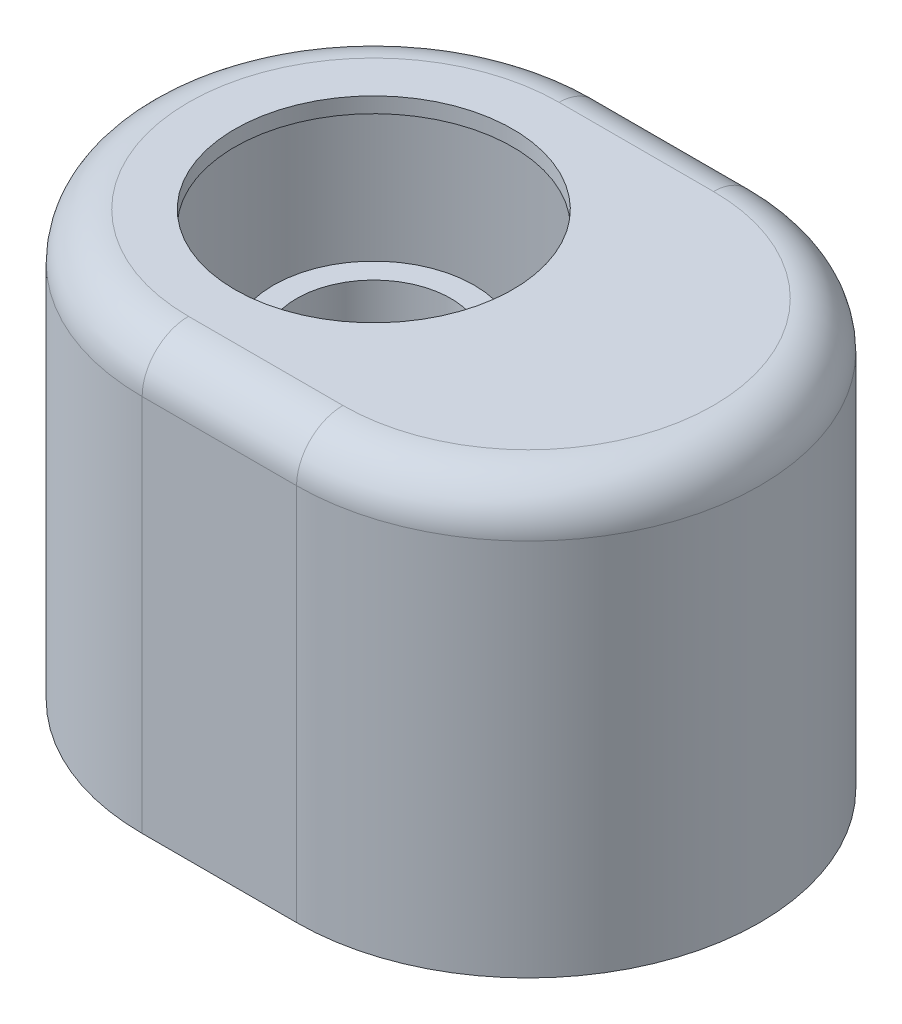
ISO-10303-21;
HEADER;
FILE_DESCRIPTION(('STEP AP214'),'2;1');
FILE_NAME('part.step','',(''),(''),'','','');
FILE_SCHEMA(('AUTOMOTIVE_DESIGN { 1 0 10303 214 1 1 1 1 }'));
ENDSEC;
DATA;
#1=APPLICATION_CONTEXT('core data for automotive mechanical design processes');
#2=APPLICATION_PROTOCOL_DEFINITION('international standard','automotive_design',2000,#1);
#3=PRODUCT_CONTEXT('',#1,'mechanical');
#4=PRODUCT('Part','Part','',(#3));
#5=PRODUCT_RELATED_PRODUCT_CATEGORY('part','',(#4));
#6=PRODUCT_DEFINITION_FORMATION('','',#4);
#7=PRODUCT_DEFINITION_CONTEXT('part definition',#1,'design');
#8=PRODUCT_DEFINITION('design','',#6,#7);
#9=PRODUCT_DEFINITION_SHAPE('','',#8);
#10=(LENGTH_UNIT() NAMED_UNIT(*) SI_UNIT(.MILLI.,.METRE.));
#11=(NAMED_UNIT(*) PLANE_ANGLE_UNIT() SI_UNIT($,.RADIAN.));
#12=(NAMED_UNIT(*) SI_UNIT($,.STERADIAN.) SOLID_ANGLE_UNIT());
#13=UNCERTAINTY_MEASURE_WITH_UNIT(LENGTH_MEASURE(1.E-05),#10,'distance_accuracy_value','');
#14=(GEOMETRIC_REPRESENTATION_CONTEXT(3) GLOBAL_UNCERTAINTY_ASSIGNED_CONTEXT((#13)) GLOBAL_UNIT_ASSIGNED_CONTEXT((#10,
#11,#12)) REPRESENTATION_CONTEXT('',''));
#15=CARTESIAN_POINT('',(0.,0.,0.));
#16=DIRECTION('',(0.,0.,1.));
#17=DIRECTION('',(1.,0.,0.));
#18=AXIS2_PLACEMENT_3D('',#15,#16,#17);
#19=CARTESIAN_POINT('',(0.,32.6328891488858,0.));
#20=DIRECTION('',(0.,1.,0.));
#21=DIRECTION('',(0.,0.,1.));
#22=AXIS2_PLACEMENT_3D('',#19,#20,#21);
#23=CONICAL_SURFACE('',#22,13.,0.528074448426359);
#24=CARTESIAN_POINT('',(0.,26.6328891488858,0.));
#25=DIRECTION('',(0.,1.,0.));
#26=DIRECTION('',(0.,0.,1.));
#27=AXIS2_PLACEMENT_3D('',#24,#25,#26);
#28=CIRCLE('',#27,9.5);
#29=CARTESIAN_POINT('',(0.,26.6328891488858,9.5));
#30=VERTEX_POINT('',#29);
#31=EDGE_CURVE('E11',#30,#30,#28,.T.);
#32=ORIENTED_EDGE('',*,*,#31,.T.);
#33=EDGE_LOOP('',(#32));
#34=FACE_BOUND('',#33,.T.);
#35=CARTESIAN_POINT('',(0.,32.6328891488858,0.));
#36=DIRECTION('',(0.,1.,0.));
#37=DIRECTION('',(0.,0.,1.));
#38=AXIS2_PLACEMENT_3D('',#35,#36,#37);
#39=CIRCLE('',#38,13.);
#40=CARTESIAN_POINT('',(0.,32.6328891488858,13.));
#41=VERTEX_POINT('',#40);
#42=EDGE_CURVE('E85',#41,#41,#39,.T.);
#43=ORIENTED_EDGE('',*,*,#42,.F.);
#44=EDGE_LOOP('',(#43));
#45=FACE_BOUND('',#44,.T.);
#46=ADVANCED_FACE('F45',(#34,#45),#23,.T.);
#47=CARTESIAN_POINT('',(0.,40.,0.));
#48=DIRECTION('',(0.,1.,0.));
#49=DIRECTION('',(0.,0.,1.));
#50=AXIS2_PLACEMENT_3D('',#47,#48,#49);
#51=CYLINDRICAL_SURFACE('',#50,9.5);
#52=CARTESIAN_POINT('',(0.,20.,0.));
#53=DIRECTION('',(0.,1.,0.));
#54=DIRECTION('',(0.,0.,1.));
#55=AXIS2_PLACEMENT_3D('',#52,#53,#54);
#56=CIRCLE('',#55,9.5);
#57=CARTESIAN_POINT('',(0.,20.,9.5));
#58=VERTEX_POINT('',#57);
#59=EDGE_CURVE('E51',#58,#58,#56,.T.);
#60=ORIENTED_EDGE('',*,*,#59,.T.);
#61=EDGE_LOOP('',(#60));
#62=FACE_BOUND('',#61,.T.);
#63=ORIENTED_EDGE('',*,*,#31,.F.);
#64=EDGE_LOOP('',(#63));
#65=FACE_BOUND('',#64,.T.);
#66=ADVANCED_FACE('F93',(#62,#65),#51,.T.);
#67=CARTESIAN_POINT('',(-9.5,20.,0.));
#68=DIRECTION('',(0.,-1.,0.));
#69=DIRECTION('',(0.,0.,-1.));
#70=AXIS2_PLACEMENT_3D('',#67,#68,#69);
#71=PLANE('',#70);
#72=CARTESIAN_POINT('',(0.,20.,0.));
#73=DIRECTION('',(0.,1.,0.));
#74=DIRECTION('',(0.,0.,1.));
#75=AXIS2_PLACEMENT_3D('',#72,#73,#74);
#76=CIRCLE('',#75,6.5);
#77=CARTESIAN_POINT('',(0.,20.,6.5));
#78=VERTEX_POINT('',#77);
#79=EDGE_CURVE('E55',#78,#78,#76,.T.);
#80=ORIENTED_EDGE('',*,*,#79,.T.);
#81=EDGE_LOOP('',(#80));
#82=FACE_BOUND('',#81,.T.);
#83=ORIENTED_EDGE('',*,*,#59,.F.);
#84=EDGE_LOOP('',(#83));
#85=FACE_BOUND('',#84,.T.);
#86=ADVANCED_FACE('F97',(#82,#85),#71,.T.);
#87=CARTESIAN_POINT('',(0.,40.,0.));
#88=DIRECTION('',(0.,1.,0.));
#89=DIRECTION('',(0.,0.,1.));
#90=AXIS2_PLACEMENT_3D('',#87,#88,#89);
#91=CYLINDRICAL_SURFACE('',#90,6.5);
#92=CARTESIAN_POINT('',(0.,24.,0.));
#93=DIRECTION('',(0.,1.,0.));
#94=DIRECTION('',(0.,0.,1.));
#95=AXIS2_PLACEMENT_3D('',#92,#93,#94);
#96=CIRCLE('',#95,6.5);
#97=CARTESIAN_POINT('',(0.,24.,6.5));
#98=VERTEX_POINT('',#97);
#99=EDGE_CURVE('E59',#98,#98,#96,.T.);
#100=ORIENTED_EDGE('',*,*,#99,.T.);
#101=EDGE_LOOP('',(#100));
#102=FACE_BOUND('',#101,.T.);
#103=ORIENTED_EDGE('',*,*,#79,.F.);
#104=EDGE_LOOP('',(#103));
#105=FACE_BOUND('',#104,.T.);
#106=ADVANCED_FACE('F101',(#102,#105),#91,.F.);
#107=CARTESIAN_POINT('',(-6.5,24.,0.));
#108=DIRECTION('',(0.,-1.,0.));
#109=DIRECTION('',(0.,0.,-1.));
#110=AXIS2_PLACEMENT_3D('',#107,#108,#109);
#111=PLANE('',#110);
#112=CARTESIAN_POINT('',(0.,24.,0.));
#113=DIRECTION('',(0.,1.,0.));
#114=DIRECTION('',(0.,0.,1.));
#115=AXIS2_PLACEMENT_3D('',#112,#113,#114);
#116=CIRCLE('',#115,4.5);
#117=CARTESIAN_POINT('',(0.,24.,4.5));
#118=VERTEX_POINT('',#117);
#119=EDGE_CURVE('E64',#118,#118,#116,.T.);
#120=ORIENTED_EDGE('',*,*,#119,.T.);
#121=EDGE_LOOP('',(#120));
#122=FACE_BOUND('',#121,.T.);
#123=ORIENTED_EDGE('',*,*,#99,.F.);
#124=EDGE_LOOP('',(#123));
#125=FACE_BOUND('',#124,.T.);
#126=ADVANCED_FACE('F108',(#122,#125),#111,.T.);
#127=CARTESIAN_POINT('',(0.,40.,0.));
#128=DIRECTION('',(0.,1.,0.));
#129=DIRECTION('',(0.,0.,1.));
#130=AXIS2_PLACEMENT_3D('',#127,#128,#129);
#131=CYLINDRICAL_SURFACE('',#130,4.5);
#132=CARTESIAN_POINT('',(0.,26.,0.));
#133=DIRECTION('',(0.,1.,0.));
#134=DIRECTION('',(0.,0.,1.));
#135=AXIS2_PLACEMENT_3D('',#132,#133,#134);
#136=CIRCLE('',#135,4.5);
#137=CARTESIAN_POINT('',(0.,26.,4.5));
#138=VERTEX_POINT('',#137);
#139=EDGE_CURVE('E67',#138,#138,#136,.T.);
#140=ORIENTED_EDGE('',*,*,#139,.T.);
#141=EDGE_LOOP('',(#140));
#142=FACE_BOUND('',#141,.T.);
#143=ORIENTED_EDGE('',*,*,#119,.F.);
#144=EDGE_LOOP('',(#143));
#145=FACE_BOUND('',#144,.T.);
#146=ADVANCED_FACE('F112',(#142,#145),#131,.F.);
#147=CARTESIAN_POINT('',(0.,26.,0.));
#148=DIRECTION('',(0.,1.,0.));
#149=DIRECTION('',(0.,0.,1.));
#150=AXIS2_PLACEMENT_3D('',#147,#148,#149);
#151=CONICAL_SURFACE('',#150,4.5,0.52807444842636);
#152=CARTESIAN_POINT('',(0.,32.,0.));
#153=DIRECTION('',(0.,1.,0.));
#154=DIRECTION('',(0.,0.,1.));
#155=AXIS2_PLACEMENT_3D('',#152,#153,#154);
#156=CIRCLE('',#155,8.);
#157=CARTESIAN_POINT('',(0.,32.,8.));
#158=VERTEX_POINT('',#157);
#159=EDGE_CURVE('E70',#158,#158,#156,.T.);
#160=ORIENTED_EDGE('',*,*,#159,.T.);
#161=EDGE_LOOP('',(#160));
#162=FACE_BOUND('',#161,.T.);
#163=ORIENTED_EDGE('',*,*,#139,.F.);
#164=EDGE_LOOP('',(#163));
#165=FACE_BOUND('',#164,.T.);
#166=ADVANCED_FACE('F116',(#162,#165),#151,.F.);
#167=CARTESIAN_POINT('',(0.,40.,0.));
#168=DIRECTION('',(0.,1.,0.));
#169=DIRECTION('',(0.,0.,1.));
#170=AXIS2_PLACEMENT_3D('',#167,#168,#169);
#171=CYLINDRICAL_SURFACE('',#170,8.);
#172=CARTESIAN_POINT('',(0.,34.,0.));
#173=DIRECTION('',(0.,1.,0.));
#174=DIRECTION('',(0.,0.,1.));
#175=AXIS2_PLACEMENT_3D('',#172,#173,#174);
#176=CIRCLE('',#175,8.);
#177=CARTESIAN_POINT('',(0.,34.,8.));
#178=VERTEX_POINT('',#177);
#179=EDGE_CURVE('E73',#178,#178,#176,.T.);
#180=ORIENTED_EDGE('',*,*,#179,.T.);
#181=EDGE_LOOP('',(#180));
#182=FACE_BOUND('',#181,.T.);
#183=ORIENTED_EDGE('',*,*,#159,.F.);
#184=EDGE_LOOP('',(#183));
#185=FACE_BOUND('',#184,.T.);
#186=ADVANCED_FACE('F120',(#182,#185),#171,.F.);
#187=CARTESIAN_POINT('',(-8.,34.,0.));
#188=DIRECTION('',(0.,1.,0.));
#189=DIRECTION('',(0.,0.,1.));
#190=AXIS2_PLACEMENT_3D('',#187,#188,#189);
#191=PLANE('',#190);
#192=CARTESIAN_POINT('',(0.,34.,0.));
#193=DIRECTION('',(0.,1.,0.));
#194=DIRECTION('',(0.,0.,1.));
#195=AXIS2_PLACEMENT_3D('',#192,#193,#194);
#196=CIRCLE('',#195,10.);
#197=CARTESIAN_POINT('',(0.,34.,10.));
#198=VERTEX_POINT('',#197);
#199=EDGE_CURVE('E76',#198,#198,#196,.T.);
#200=ORIENTED_EDGE('',*,*,#199,.T.);
#201=EDGE_LOOP('',(#200));
#202=FACE_BOUND('',#201,.T.);
#203=ORIENTED_EDGE('',*,*,#179,.F.);
#204=EDGE_LOOP('',(#203));
#205=FACE_BOUND('',#204,.T.);
#206=ADVANCED_FACE('F124',(#202,#205),#191,.T.);
#207=CARTESIAN_POINT('',(0.,40.,0.));
#208=DIRECTION('',(0.,1.,0.));
#209=DIRECTION('',(0.,0.,1.));
#210=AXIS2_PLACEMENT_3D('',#207,#208,#209);
#211=CYLINDRICAL_SURFACE('',#210,10.);
#212=CARTESIAN_POINT('',(0.,40.,0.));
#213=DIRECTION('',(0.,1.,0.));
#214=DIRECTION('',(0.,0.,1.));
#215=AXIS2_PLACEMENT_3D('',#212,#213,#214);
#216=CIRCLE('',#215,10.);
#217=CARTESIAN_POINT('',(0.,40.,10.));
#218=VERTEX_POINT('',#217);
#219=EDGE_CURVE('E79',#218,#218,#216,.T.);
#220=ORIENTED_EDGE('',*,*,#219,.T.);
#221=EDGE_LOOP('',(#220));
#222=FACE_BOUND('',#221,.T.);
#223=ORIENTED_EDGE('',*,*,#199,.F.);
#224=EDGE_LOOP('',(#223));
#225=FACE_BOUND('',#224,.T.);
#226=ADVANCED_FACE('F128',(#222,#225),#211,.F.);
#227=CARTESIAN_POINT('',(-10.,40.,0.));
#228=DIRECTION('',(0.,1.,0.));
#229=DIRECTION('',(0.,0.,1.));
#230=AXIS2_PLACEMENT_3D('',#227,#228,#229);
#231=PLANE('',#230);
#232=CARTESIAN_POINT('',(0.,40.,0.));
#233=DIRECTION('',(0.,1.,0.));
#234=DIRECTION('',(0.,0.,1.));
#235=AXIS2_PLACEMENT_3D('',#232,#233,#234);
#236=CIRCLE('',#235,13.);
#237=CARTESIAN_POINT('',(0.,40.,13.));
#238=VERTEX_POINT('',#237);
#239=EDGE_CURVE('E82',#238,#238,#236,.T.);
#240=ORIENTED_EDGE('',*,*,#239,.T.);
#241=EDGE_LOOP('',(#240));
#242=FACE_BOUND('',#241,.T.);
#243=ORIENTED_EDGE('',*,*,#219,.F.);
#244=EDGE_LOOP('',(#243));
#245=FACE_BOUND('',#244,.T.);
#246=ADVANCED_FACE('F132',(#242,#245),#231,.T.);
#247=CARTESIAN_POINT('',(0.,40.,0.));
#248=DIRECTION('',(0.,1.,0.));
#249=DIRECTION('',(0.,0.,1.));
#250=AXIS2_PLACEMENT_3D('',#247,#248,#249);
#251=CYLINDRICAL_SURFACE('',#250,13.);
#252=ORIENTED_EDGE('',*,*,#42,.T.);
#253=EDGE_LOOP('',(#252));
#254=FACE_BOUND('',#253,.T.);
#255=ORIENTED_EDGE('',*,*,#239,.F.);
#256=EDGE_LOOP('',(#255));
#257=FACE_BOUND('',#256,.T.);
#258=ADVANCED_FACE('F89',(#254,#257),#251,.T.);
#259=CLOSED_SHELL('',(#46,#66,#86,#106,#126,#146,#166,#186,#206,#226,#246,#258));
#260=MANIFOLD_SOLID_BREP('B2',#259);
#261=CARTESIAN_POINT('',(0.,55.,0.));
#262=DIRECTION('',(0.,-1.,0.));
#263=DIRECTION('',(0.,0.,-1.));
#264=AXIS2_PLACEMENT_3D('',#261,#262,#263);
#265=CYLINDRICAL_SURFACE('',#264,30.);
#266=DIRECTION('',(0.,-1.,0.));
#267=VECTOR('',#266,1.);
#268=CARTESIAN_POINT('',(0.,55.,30.));
#269=LINE('',#268,#267);
#270=CARTESIAN_POINT('',(0.,49.,30.));
#271=VERTEX_POINT('',#270);
#272=CARTESIAN_POINT('',(0.,0.,30.));
#273=VERTEX_POINT('',#272);
#274=EDGE_CURVE('E388',#271,#273,#269,.T.);
#275=ORIENTED_EDGE('',*,*,#274,.F.);
#276=CARTESIAN_POINT('',(0.,49.,0.));
#277=DIRECTION('',(0.,1.,0.));
#278=DIRECTION('',(0.,0.,1.));
#279=AXIS2_PLACEMENT_3D('',#276,#277,#278);
#280=CIRCLE('',#279,30.);
#281=CARTESIAN_POINT('',(0.,49.,-30.));
#282=VERTEX_POINT('',#281);
#283=EDGE_CURVE('E43',#271,#282,#280,.F.);
#284=ORIENTED_EDGE('',*,*,#283,.T.);
#285=DIRECTION('',(0.,-1.,0.));
#286=VECTOR('',#285,1.);
#287=CARTESIAN_POINT('',(0.,55.,-30.));
#288=LINE('',#287,#286);
#289=CARTESIAN_POINT('',(0.,0.,-30.));
#290=VERTEX_POINT('',#289);
#291=EDGE_CURVE('E382',#282,#290,#288,.T.);
#292=ORIENTED_EDGE('',*,*,#291,.T.);
#293=CARTESIAN_POINT('',(0.,0.,0.));
#294=DIRECTION('',(0.,1.,0.));
#295=DIRECTION('',(0.,0.,1.));
#296=AXIS2_PLACEMENT_3D('',#293,#294,#295);
#297=CIRCLE('',#296,30.);
#298=EDGE_CURVE('E369',#290,#273,#297,.T.);
#299=ORIENTED_EDGE('',*,*,#298,.T.);
#300=EDGE_LOOP('',(#275,#284,#292,#299));
#301=FACE_BOUND('',#300,.T.);
#302=ADVANCED_FACE('F227',(#301),#265,.T.);
#303=CARTESIAN_POINT('',(0.,55.,30.));
#304=DIRECTION('',(0.,0.,-1.));
#305=DIRECTION('',(-1.,0.,0.));
#306=AXIS2_PLACEMENT_3D('',#303,#304,#305);
#307=PLANE('',#306);
#308=DIRECTION('',(0.,-1.,0.));
#309=VECTOR('',#308,1.);
#310=CARTESIAN_POINT('',(20.,55.,30.));
#311=LINE('',#310,#309);
#312=CARTESIAN_POINT('',(20.,49.,30.));
#313=VERTEX_POINT('',#312);
#314=CARTESIAN_POINT('',(20.,0.,30.));
#315=VERTEX_POINT('',#314);
#316=EDGE_CURVE('E386',#313,#315,#311,.T.);
#317=ORIENTED_EDGE('',*,*,#316,.F.);
#318=DIRECTION('',(1.,0.,0.));
#319=VECTOR('',#318,1.);
#320=CARTESIAN_POINT('',(0.,49.,30.));
#321=LINE('',#320,#319);
#322=EDGE_CURVE('E236',#313,#271,#321,.F.);
#323=ORIENTED_EDGE('',*,*,#322,.T.);
#324=ORIENTED_EDGE('',*,*,#274,.T.);
#325=DIRECTION('',(1.,0.,0.));
#326=VECTOR('',#325,1.);
#327=CARTESIAN_POINT('',(0.,0.,30.));
#328=LINE('',#327,#326);
#329=EDGE_CURVE('E372',#273,#315,#328,.T.);
#330=ORIENTED_EDGE('',*,*,#329,.T.);
#331=EDGE_LOOP('',(#317,#323,#324,#330));
#332=FACE_BOUND('',#331,.T.);
#333=ADVANCED_FACE('F453',(#332),#307,.F.);
#334=CARTESIAN_POINT('',(20.,55.,0.));
#335=DIRECTION('',(0.,-1.,0.));
#336=DIRECTION('',(0.,0.,-1.));
#337=AXIS2_PLACEMENT_3D('',#334,#335,#336);
#338=CYLINDRICAL_SURFACE('',#337,30.);
#339=DIRECTION('',(0.,-1.,0.));
#340=VECTOR('',#339,1.);
#341=CARTESIAN_POINT('',(20.,55.,-30.));
#342=LINE('',#341,#340);
#343=CARTESIAN_POINT('',(20.,49.,-30.));
#344=VERTEX_POINT('',#343);
#345=CARTESIAN_POINT('',(20.,0.,-30.));
#346=VERTEX_POINT('',#345);
#347=EDGE_CURVE('E384',#344,#346,#342,.T.);
#348=ORIENTED_EDGE('',*,*,#347,.F.);
#349=CARTESIAN_POINT('',(20.,49.,0.));
#350=DIRECTION('',(0.,1.,0.));
#351=DIRECTION('',(0.,0.,1.));
#352=AXIS2_PLACEMENT_3D('',#349,#350,#351);
#353=CIRCLE('',#352,30.);
#354=EDGE_CURVE('E402',#344,#313,#353,.F.);
#355=ORIENTED_EDGE('',*,*,#354,.T.);
#356=ORIENTED_EDGE('',*,*,#316,.T.);
#357=CARTESIAN_POINT('',(20.,0.,0.));
#358=DIRECTION('',(0.,1.,0.));
#359=DIRECTION('',(0.,0.,1.));
#360=AXIS2_PLACEMENT_3D('',#357,#358,#359);
#361=CIRCLE('',#360,30.);
#362=EDGE_CURVE('E376',#315,#346,#361,.T.);
#363=ORIENTED_EDGE('',*,*,#362,.T.);
#364=EDGE_LOOP('',(#348,#355,#356,#363));
#365=FACE_BOUND('',#364,.T.);
#366=ADVANCED_FACE('F448',(#365),#338,.T.);
#367=CARTESIAN_POINT('',(0.,55.,-30.));
#368=DIRECTION('',(0.,0.,1.));
#369=DIRECTION('',(1.,0.,0.));
#370=AXIS2_PLACEMENT_3D('',#367,#368,#369);
#371=PLANE('',#370);
#372=ORIENTED_EDGE('',*,*,#291,.F.);
#373=DIRECTION('',(-1.,0.,0.));
#374=VECTOR('',#373,1.);
#375=CARTESIAN_POINT('',(20.,49.,-30.));
#376=LINE('',#375,#374);
#377=EDGE_CURVE('E399',#282,#344,#376,.F.);
#378=ORIENTED_EDGE('',*,*,#377,.T.);
#379=ORIENTED_EDGE('',*,*,#347,.T.);
#380=DIRECTION('',(-1.,0.,0.));
#381=VECTOR('',#380,1.);
#382=CARTESIAN_POINT('',(0.,0.,-30.));
#383=LINE('',#382,#381);
#384=EDGE_CURVE('E379',#346,#290,#383,.T.);
#385=ORIENTED_EDGE('',*,*,#384,.T.);
#386=EDGE_LOOP('',(#372,#378,#379,#385));
#387=FACE_BOUND('',#386,.T.);
#388=ADVANCED_FACE('F429',(#387),#371,.F.);
#389=CARTESIAN_POINT('',(0.,55.,0.));
#390=DIRECTION('',(0.,1.,0.));
#391=DIRECTION('',(0.,0.,1.));
#392=AXIS2_PLACEMENT_3D('',#389,#390,#391);
#393=PLANE('',#392);
#394=CARTESIAN_POINT('',(0.,55.,0.));
#395=DIRECTION('',(0.,1.,0.));
#396=DIRECTION('',(0.,0.,1.));
#397=AXIS2_PLACEMENT_3D('',#394,#395,#396);
#398=CIRCLE('',#397,18.);
#399=CARTESIAN_POINT('',(0.,55.,18.));
#400=VERTEX_POINT('',#399);
#401=EDGE_CURVE('E358',#400,#400,#398,.T.);
#402=ORIENTED_EDGE('',*,*,#401,.F.);
#403=EDGE_LOOP('',(#402));
#404=FACE_BOUND('',#403,.T.);
#405=CARTESIAN_POINT('',(20.,55.,0.));
#406=DIRECTION('',(0.,1.,0.));
#407=DIRECTION('',(0.,0.,1.));
#408=AXIS2_PLACEMENT_3D('',#405,#406,#407);
#409=CIRCLE('',#408,24.);
#410=CARTESIAN_POINT('',(20.,55.,24.));
#411=VERTEX_POINT('',#410);
#412=CARTESIAN_POINT('',(20.,55.,-24.));
#413=VERTEX_POINT('',#412);
#414=EDGE_CURVE('E394',#411,#413,#409,.T.);
#415=ORIENTED_EDGE('',*,*,#414,.T.);
#416=DIRECTION('',(-1.,0.,0.));
#417=VECTOR('',#416,1.);
#418=CARTESIAN_POINT('',(0.,55.,-24.));
#419=LINE('',#418,#417);
#420=CARTESIAN_POINT('',(0.,55.,-24.));
#421=VERTEX_POINT('',#420);
#422=EDGE_CURVE('E396',#413,#421,#419,.T.);
#423=ORIENTED_EDGE('',*,*,#422,.T.);
#424=CARTESIAN_POINT('',(0.,55.,0.));
#425=DIRECTION('',(0.,1.,0.));
#426=DIRECTION('',(0.,0.,1.));
#427=AXIS2_PLACEMENT_3D('',#424,#425,#426);
#428=CIRCLE('',#427,24.);
#429=CARTESIAN_POINT('',(0.,55.,24.));
#430=VERTEX_POINT('',#429);
#431=EDGE_CURVE('E390',#421,#430,#428,.T.);
#432=ORIENTED_EDGE('',*,*,#431,.T.);
#433=DIRECTION('',(1.,0.,0.));
#434=VECTOR('',#433,1.);
#435=CARTESIAN_POINT('',(20.,55.,24.));
#436=LINE('',#435,#434);
#437=EDGE_CURVE('E392',#430,#411,#436,.T.);
#438=ORIENTED_EDGE('',*,*,#437,.T.);
#439=EDGE_LOOP('',(#415,#423,#432,#438));
#440=FACE_BOUND('',#439,.T.);
#441=ADVANCED_FACE('F437',(#404,#440),#393,.T.);
#442=CARTESIAN_POINT('',(0.,0.,0.));
#443=DIRECTION('',(0.,1.,0.));
#444=DIRECTION('',(0.,0.,1.));
#445=AXIS2_PLACEMENT_3D('',#442,#443,#444);
#446=PLANE('',#445);
#447=DIRECTION('',(-1.,0.,0.));
#448=VECTOR('',#447,1.);
#449=CARTESIAN_POINT('',(0.,0.,-28.));
#450=LINE('',#449,#448);
#451=CARTESIAN_POINT('',(20.,0.,-28.));
#452=VERTEX_POINT('',#451);
#453=CARTESIAN_POINT('',(0.,0.,-28.));
#454=VERTEX_POINT('',#453);
#455=EDGE_CURVE('E340',#452,#454,#450,.T.);
#456=ORIENTED_EDGE('',*,*,#455,.T.);
#457=CARTESIAN_POINT('',(0.,0.,0.));
#458=DIRECTION('',(0.,1.,0.));
#459=DIRECTION('',(0.,0.,1.));
#460=AXIS2_PLACEMENT_3D('',#457,#458,#459);
#461=CIRCLE('',#460,28.);
#462=CARTESIAN_POINT('',(0.,0.,28.));
#463=VERTEX_POINT('',#462);
#464=EDGE_CURVE('E335',#454,#463,#461,.T.);
#465=ORIENTED_EDGE('',*,*,#464,.T.);
#466=DIRECTION('',(1.,0.,0.));
#467=VECTOR('',#466,1.);
#468=CARTESIAN_POINT('',(0.,0.,28.));
#469=LINE('',#468,#467);
#470=CARTESIAN_POINT('',(20.,0.,28.));
#471=VERTEX_POINT('',#470);
#472=EDGE_CURVE('E363',#463,#471,#469,.T.);
#473=ORIENTED_EDGE('',*,*,#472,.T.);
#474=CARTESIAN_POINT('',(20.,0.,0.));
#475=DIRECTION('',(0.,1.,0.));
#476=DIRECTION('',(0.,0.,1.));
#477=AXIS2_PLACEMENT_3D('',#474,#475,#476);
#478=CIRCLE('',#477,28.);
#479=EDGE_CURVE('E244',#471,#452,#478,.T.);
#480=ORIENTED_EDGE('',*,*,#479,.T.);
#481=EDGE_LOOP('',(#456,#465,#473,#480));
#482=FACE_BOUND('',#481,.T.);
#483=ORIENTED_EDGE('',*,*,#298,.F.);
#484=ORIENTED_EDGE('',*,*,#384,.F.);
#485=ORIENTED_EDGE('',*,*,#362,.F.);
#486=ORIENTED_EDGE('',*,*,#329,.F.);
#487=EDGE_LOOP('',(#483,#484,#485,#486));
#488=FACE_BOUND('',#487,.T.);
#489=ADVANCED_FACE('F439',(#482,#488),#446,.F.);
#490=CARTESIAN_POINT('',(0.,49.,24.));
#491=DIRECTION('',(-1.,0.,0.));
#492=DIRECTION('',(0.,0.,1.));
#493=AXIS2_PLACEMENT_3D('',#490,#491,#492);
#494=CYLINDRICAL_SURFACE('',#493,6.);
#495=CARTESIAN_POINT('',(0.,49.,24.));
#496=DIRECTION('',(-1.,0.,0.));
#497=DIRECTION('',(0.,0.,1.));
#498=AXIS2_PLACEMENT_3D('',#495,#496,#497);
#499=CIRCLE('',#498,6.);
#500=EDGE_CURVE('E408',#271,#430,#499,.T.);
#501=ORIENTED_EDGE('',*,*,#500,.F.);
#502=ORIENTED_EDGE('',*,*,#322,.F.);
#503=CARTESIAN_POINT('',(20.,49.,24.));
#504=DIRECTION('',(1.,0.,0.));
#505=DIRECTION('',(0.,0.,-1.));
#506=AXIS2_PLACEMENT_3D('',#503,#504,#505);
#507=CIRCLE('',#506,6.);
#508=EDGE_CURVE('E373',#411,#313,#507,.T.);
#509=ORIENTED_EDGE('',*,*,#508,.F.);
#510=ORIENTED_EDGE('',*,*,#437,.F.);
#511=EDGE_LOOP('',(#501,#502,#509,#510));
#512=FACE_BOUND('',#511,.T.);
#513=ADVANCED_FACE('F229',(#512),#494,.T.);
#514=CARTESIAN_POINT('',(20.,49.,0.));
#515=DIRECTION('',(0.,1.,0.));
#516=DIRECTION('',(0.,0.,1.));
#517=AXIS2_PLACEMENT_3D('',#514,#515,#516);
#518=TOROIDAL_SURFACE('',#517,24.,6.);
#519=ORIENTED_EDGE('',*,*,#508,.T.);
#520=ORIENTED_EDGE('',*,*,#354,.F.);
#521=CARTESIAN_POINT('',(20.,49.,-24.));
#522=DIRECTION('',(-1.,0.,0.));
#523=DIRECTION('',(0.,0.,1.));
#524=AXIS2_PLACEMENT_3D('',#521,#522,#523);
#525=CIRCLE('',#524,6.);
#526=EDGE_CURVE('E406',#413,#344,#525,.T.);
#527=ORIENTED_EDGE('',*,*,#526,.F.);
#528=ORIENTED_EDGE('',*,*,#414,.F.);
#529=EDGE_LOOP('',(#519,#520,#527,#528));
#530=FACE_BOUND('',#529,.T.);
#531=ADVANCED_FACE('F415',(#530),#518,.T.);
#532=CARTESIAN_POINT('',(0.,49.,0.));
#533=DIRECTION('',(0.,1.,0.));
#534=DIRECTION('',(0.,0.,1.));
#535=AXIS2_PLACEMENT_3D('',#532,#533,#534);
#536=TOROIDAL_SURFACE('',#535,24.,6.);
#537=ORIENTED_EDGE('',*,*,#500,.T.);
#538=ORIENTED_EDGE('',*,*,#431,.F.);
#539=CARTESIAN_POINT('',(0.,49.,-24.));
#540=DIRECTION('',(1.,0.,0.));
#541=DIRECTION('',(0.,0.,-1.));
#542=AXIS2_PLACEMENT_3D('',#539,#540,#541);
#543=CIRCLE('',#542,6.);
#544=EDGE_CURVE('E327',#282,#421,#543,.T.);
#545=ORIENTED_EDGE('',*,*,#544,.F.);
#546=ORIENTED_EDGE('',*,*,#283,.F.);
#547=EDGE_LOOP('',(#537,#538,#545,#546));
#548=FACE_BOUND('',#547,.T.);
#549=ADVANCED_FACE('F424',(#548),#536,.T.);
#550=CARTESIAN_POINT('',(0.,49.,-24.));
#551=DIRECTION('',(1.,0.,0.));
#552=DIRECTION('',(0.,0.,-1.));
#553=AXIS2_PLACEMENT_3D('',#550,#551,#552);
#554=CYLINDRICAL_SURFACE('',#553,6.);
#555=ORIENTED_EDGE('',*,*,#526,.T.);
#556=ORIENTED_EDGE('',*,*,#377,.F.);
#557=ORIENTED_EDGE('',*,*,#544,.T.);
#558=ORIENTED_EDGE('',*,*,#422,.F.);
#559=EDGE_LOOP('',(#555,#556,#557,#558));
#560=FACE_BOUND('',#559,.T.);
#561=ADVANCED_FACE('F434',(#560),#554,.T.);
#562=CARTESIAN_POINT('',(0.,55.,0.));
#563=DIRECTION('',(0.,-1.,0.));
#564=DIRECTION('',(0.,0.,-1.));
#565=AXIS2_PLACEMENT_3D('',#562,#563,#564);
#566=CYLINDRICAL_SURFACE('',#565,28.);
#567=DIRECTION('',(0.,1.,0.));
#568=VECTOR('',#567,1.);
#569=CARTESIAN_POINT('',(0.,55.,28.));
#570=LINE('',#569,#568);
#571=CARTESIAN_POINT('',(0.,49.,28.));
#572=VERTEX_POINT('',#571);
#573=EDGE_CURVE('E592',#572,#463,#570,.F.);
#574=ORIENTED_EDGE('',*,*,#573,.T.);
#575=ORIENTED_EDGE('',*,*,#464,.F.);
#576=DIRECTION('',(0.,-1.,0.));
#577=VECTOR('',#576,1.);
#578=CARTESIAN_POINT('',(0.,55.,-28.));
#579=LINE('',#578,#577);
#580=CARTESIAN_POINT('',(0.,49.,-28.));
#581=VERTEX_POINT('',#580);
#582=EDGE_CURVE('E331',#581,#454,#579,.T.);
#583=ORIENTED_EDGE('',*,*,#582,.F.);
#584=CARTESIAN_POINT('',(0.,49.,0.));
#585=DIRECTION('',(0.,-1.,0.));
#586=DIRECTION('',(0.,0.,-1.));
#587=AXIS2_PLACEMENT_3D('',#584,#585,#586);
#588=CIRCLE('',#587,28.);
#589=EDGE_CURVE('E318',#572,#581,#588,.T.);
#590=ORIENTED_EDGE('',*,*,#589,.F.);
#591=EDGE_LOOP('',(#574,#575,#583,#590));
#592=FACE_BOUND('',#591,.T.);
#593=ADVANCED_FACE('F333',(#592),#566,.F.);
#594=CARTESIAN_POINT('',(0.,55.,28.));
#595=DIRECTION('',(0.,0.,-1.));
#596=DIRECTION('',(-1.,0.,0.));
#597=AXIS2_PLACEMENT_3D('',#594,#595,#596);
#598=PLANE('',#597);
#599=DIRECTION('',(0.,-1.,0.));
#600=VECTOR('',#599,1.);
#601=CARTESIAN_POINT('',(20.,55.,28.));
#602=LINE('',#601,#600);
#603=CARTESIAN_POINT('',(20.,49.,28.));
#604=VERTEX_POINT('',#603);
#605=EDGE_CURVE('E593',#604,#471,#602,.T.);
#606=ORIENTED_EDGE('',*,*,#605,.T.);
#607=ORIENTED_EDGE('',*,*,#472,.F.);
#608=ORIENTED_EDGE('',*,*,#573,.F.);
#609=DIRECTION('',(-1.,0.,0.));
#610=VECTOR('',#609,1.);
#611=CARTESIAN_POINT('',(0.,49.,28.));
#612=LINE('',#611,#610);
#613=EDGE_CURVE('E328',#604,#572,#612,.T.);
#614=ORIENTED_EDGE('',*,*,#613,.F.);
#615=EDGE_LOOP('',(#606,#607,#608,#614));
#616=FACE_BOUND('',#615,.T.);
#617=ADVANCED_FACE('F489',(#616),#598,.T.);
#618=CARTESIAN_POINT('',(20.,55.,0.));
#619=DIRECTION('',(0.,-1.,0.));
#620=DIRECTION('',(0.,0.,-1.));
#621=AXIS2_PLACEMENT_3D('',#618,#619,#620);
#622=CYLINDRICAL_SURFACE('',#621,28.);
#623=DIRECTION('',(0.,1.,0.));
#624=VECTOR('',#623,1.);
#625=CARTESIAN_POINT('',(20.,55.,-28.));
#626=LINE('',#625,#624);
#627=CARTESIAN_POINT('',(20.,49.,-28.));
#628=VERTEX_POINT('',#627);
#629=EDGE_CURVE('E339',#628,#452,#626,.F.);
#630=ORIENTED_EDGE('',*,*,#629,.T.);
#631=ORIENTED_EDGE('',*,*,#479,.F.);
#632=ORIENTED_EDGE('',*,*,#605,.F.);
#633=CARTESIAN_POINT('',(20.,49.,0.));
#634=DIRECTION('',(0.,-1.,0.));
#635=DIRECTION('',(0.,0.,-1.));
#636=AXIS2_PLACEMENT_3D('',#633,#634,#635);
#637=CIRCLE('',#636,28.);
#638=EDGE_CURVE('E348',#628,#604,#637,.T.);
#639=ORIENTED_EDGE('',*,*,#638,.F.);
#640=EDGE_LOOP('',(#630,#631,#632,#639));
#641=FACE_BOUND('',#640,.T.);
#642=ADVANCED_FACE('F498',(#641),#622,.F.);
#643=CARTESIAN_POINT('',(0.,55.,-28.));
#644=DIRECTION('',(0.,0.,1.));
#645=DIRECTION('',(1.,0.,0.));
#646=AXIS2_PLACEMENT_3D('',#643,#644,#645);
#647=PLANE('',#646);
#648=ORIENTED_EDGE('',*,*,#582,.T.);
#649=ORIENTED_EDGE('',*,*,#455,.F.);
#650=ORIENTED_EDGE('',*,*,#629,.F.);
#651=DIRECTION('',(1.,0.,0.));
#652=VECTOR('',#651,1.);
#653=CARTESIAN_POINT('',(0.,49.,-28.));
#654=LINE('',#653,#652);
#655=EDGE_CURVE('E344',#581,#628,#654,.T.);
#656=ORIENTED_EDGE('',*,*,#655,.F.);
#657=EDGE_LOOP('',(#648,#649,#650,#656));
#658=FACE_BOUND('',#657,.T.);
#659=ADVANCED_FACE('F345',(#658),#647,.T.);
#660=CARTESIAN_POINT('',(0.,53.,0.));
#661=DIRECTION('',(0.,1.,0.));
#662=DIRECTION('',(0.,0.,1.));
#663=AXIS2_PLACEMENT_3D('',#660,#661,#662);
#664=PLANE('',#663);
#665=CARTESIAN_POINT('',(0.,53.,0.));
#666=DIRECTION('',(0.,1.,0.));
#667=DIRECTION('',(0.,0.,1.));
#668=AXIS2_PLACEMENT_3D('',#665,#666,#667);
#669=CIRCLE('',#668,18.);
#670=CARTESIAN_POINT('',(0.,53.,18.));
#671=VERTEX_POINT('',#670);
#672=EDGE_CURVE('E231',#671,#671,#669,.T.);
#673=ORIENTED_EDGE('',*,*,#672,.T.);
#674=EDGE_LOOP('',(#673));
#675=FACE_BOUND('',#674,.T.);
#676=CARTESIAN_POINT('',(20.,53.,0.));
#677=DIRECTION('',(0.,1.,0.));
#678=DIRECTION('',(0.,0.,1.));
#679=AXIS2_PLACEMENT_3D('',#676,#677,#678);
#680=CIRCLE('',#679,24.);
#681=CARTESIAN_POINT('',(20.,53.,24.));
#682=VERTEX_POINT('',#681);
#683=CARTESIAN_POINT('',(20.,53.,-24.));
#684=VERTEX_POINT('',#683);
#685=EDGE_CURVE('E584',#682,#684,#680,.T.);
#686=ORIENTED_EDGE('',*,*,#685,.F.);
#687=DIRECTION('',(1.,0.,0.));
#688=VECTOR('',#687,1.);
#689=CARTESIAN_POINT('',(0.,53.,24.));
#690=LINE('',#689,#688);
#691=CARTESIAN_POINT('',(0.,53.,24.));
#692=VERTEX_POINT('',#691);
#693=EDGE_CURVE('E585',#692,#682,#690,.T.);
#694=ORIENTED_EDGE('',*,*,#693,.F.);
#695=CARTESIAN_POINT('',(0.,53.,0.));
#696=DIRECTION('',(0.,1.,0.));
#697=DIRECTION('',(0.,0.,1.));
#698=AXIS2_PLACEMENT_3D('',#695,#696,#697);
#699=CIRCLE('',#698,24.);
#700=CARTESIAN_POINT('',(0.,53.,-24.));
#701=VERTEX_POINT('',#700);
#702=EDGE_CURVE('E589',#701,#692,#699,.T.);
#703=ORIENTED_EDGE('',*,*,#702,.F.);
#704=DIRECTION('',(1.,0.,0.));
#705=VECTOR('',#704,1.);
#706=CARTESIAN_POINT('',(0.,53.,-24.));
#707=LINE('',#706,#705);
#708=EDGE_CURVE('E349',#684,#701,#707,.F.);
#709=ORIENTED_EDGE('',*,*,#708,.F.);
#710=EDGE_LOOP('',(#686,#694,#703,#709));
#711=FACE_BOUND('',#710,.T.);
#712=ADVANCED_FACE('F516',(#675,#711),#664,.F.);
#713=CARTESIAN_POINT('',(0.,49.,24.));
#714=DIRECTION('',(-1.,0.,0.));
#715=DIRECTION('',(0.,0.,1.));
#716=AXIS2_PLACEMENT_3D('',#713,#714,#715);
#717=CYLINDRICAL_SURFACE('',#716,4.);
#718=CARTESIAN_POINT('',(0.,49.,24.));
#719=DIRECTION('',(-1.,0.,0.));
#720=DIRECTION('',(0.,0.,1.));
#721=AXIS2_PLACEMENT_3D('',#718,#719,#720);
#722=CIRCLE('',#721,4.);
#723=EDGE_CURVE('E325',#572,#692,#722,.T.);
#724=ORIENTED_EDGE('',*,*,#723,.T.);
#725=ORIENTED_EDGE('',*,*,#693,.T.);
#726=CARTESIAN_POINT('',(20.,49.,24.));
#727=DIRECTION('',(-1.,0.,0.));
#728=DIRECTION('',(0.,0.,1.));
#729=AXIS2_PLACEMENT_3D('',#726,#727,#728);
#730=CIRCLE('',#729,4.);
#731=EDGE_CURVE('E364',#682,#604,#730,.F.);
#732=ORIENTED_EDGE('',*,*,#731,.T.);
#733=ORIENTED_EDGE('',*,*,#613,.T.);
#734=EDGE_LOOP('',(#724,#725,#732,#733));
#735=FACE_BOUND('',#734,.T.);
#736=ADVANCED_FACE('F523',(#735),#717,.F.);
#737=CARTESIAN_POINT('',(20.,49.,0.));
#738=DIRECTION('',(0.,1.,0.));
#739=DIRECTION('',(0.,0.,1.));
#740=AXIS2_PLACEMENT_3D('',#737,#738,#739);
#741=TOROIDAL_SURFACE('',#740,24.,4.);
#742=ORIENTED_EDGE('',*,*,#731,.F.);
#743=ORIENTED_EDGE('',*,*,#685,.T.);
#744=CARTESIAN_POINT('',(20.,49.,-24.));
#745=DIRECTION('',(1.,0.,0.));
#746=DIRECTION('',(0.,0.,-1.));
#747=AXIS2_PLACEMENT_3D('',#744,#745,#746);
#748=CIRCLE('',#747,4.);
#749=EDGE_CURVE('E354',#684,#628,#748,.F.);
#750=ORIENTED_EDGE('',*,*,#749,.T.);
#751=ORIENTED_EDGE('',*,*,#638,.T.);
#752=EDGE_LOOP('',(#742,#743,#750,#751));
#753=FACE_BOUND('',#752,.T.);
#754=ADVANCED_FACE('F528',(#753),#741,.F.);
#755=CARTESIAN_POINT('',(0.,49.,0.));
#756=DIRECTION('',(0.,1.,0.));
#757=DIRECTION('',(0.,0.,1.));
#758=AXIS2_PLACEMENT_3D('',#755,#756,#757);
#759=TOROIDAL_SURFACE('',#758,24.,4.);
#760=ORIENTED_EDGE('',*,*,#723,.F.);
#761=ORIENTED_EDGE('',*,*,#589,.T.);
#762=CARTESIAN_POINT('',(0.,49.,-24.));
#763=DIRECTION('',(1.,0.,0.));
#764=DIRECTION('',(0.,0.,-1.));
#765=AXIS2_PLACEMENT_3D('',#762,#763,#764);
#766=CIRCLE('',#765,4.);
#767=EDGE_CURVE('E322',#581,#701,#766,.T.);
#768=ORIENTED_EDGE('',*,*,#767,.T.);
#769=ORIENTED_EDGE('',*,*,#702,.T.);
#770=EDGE_LOOP('',(#760,#761,#768,#769));
#771=FACE_BOUND('',#770,.T.);
#772=ADVANCED_FACE('F320',(#771),#759,.F.);
#773=CARTESIAN_POINT('',(0.,49.,-24.));
#774=DIRECTION('',(1.,0.,0.));
#775=DIRECTION('',(0.,0.,-1.));
#776=AXIS2_PLACEMENT_3D('',#773,#774,#775);
#777=CYLINDRICAL_SURFACE('',#776,4.);
#778=ORIENTED_EDGE('',*,*,#749,.F.);
#779=ORIENTED_EDGE('',*,*,#708,.T.);
#780=ORIENTED_EDGE('',*,*,#767,.F.);
#781=ORIENTED_EDGE('',*,*,#655,.T.);
#782=EDGE_LOOP('',(#778,#779,#780,#781));
#783=FACE_BOUND('',#782,.T.);
#784=ADVANCED_FACE('F352',(#783),#777,.F.);
#785=CARTESIAN_POINT('',(0.,0.,0.));
#786=DIRECTION('',(0.,1.,0.));
#787=DIRECTION('',(0.,0.,1.));
#788=AXIS2_PLACEMENT_3D('',#785,#786,#787);
#789=CYLINDRICAL_SURFACE('',#788,18.);
#790=ORIENTED_EDGE('',*,*,#401,.T.);
#791=EDGE_LOOP('',(#790));
#792=FACE_BOUND('',#791,.T.);
#793=ORIENTED_EDGE('',*,*,#672,.F.);
#794=EDGE_LOOP('',(#793));
#795=FACE_BOUND('',#794,.T.);
#796=ADVANCED_FACE('F554',(#792,#795),#789,.F.);
#797=CLOSED_SHELL('',(#302,#333,#366,#388,#441,#489,#513,#531,#549,#561,#593,#617,#642,#659,
#712,#736,#754,#772,#784,#796));
#798=MANIFOLD_SOLID_BREP('B6',#797);
#799=ADVANCED_BREP_SHAPE_REPRESENTATION('',(#18,#260,#798),#14);
#800=SHAPE_DEFINITION_REPRESENTATION(#9,#799);
ENDSEC;
END-ISO-10303-21;
